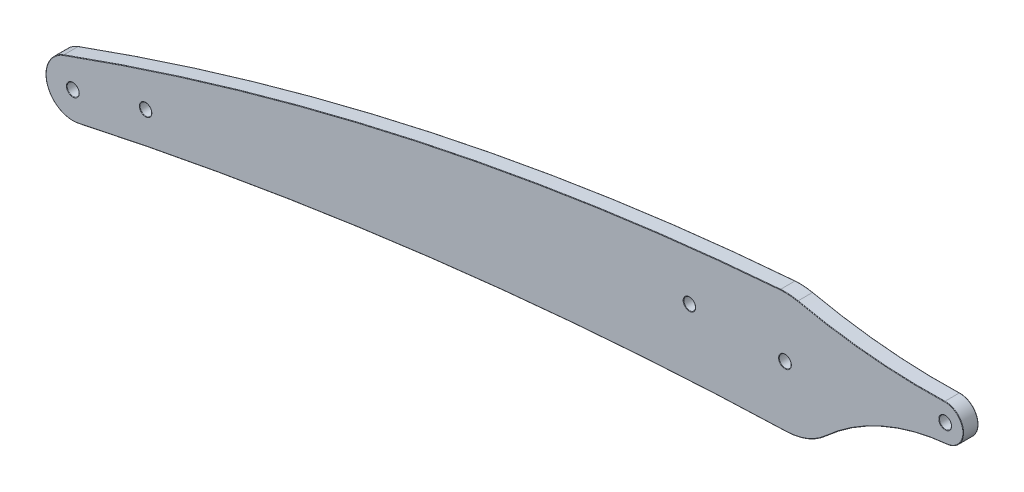
ISO-10303-21;
HEADER;
FILE_DESCRIPTION(('STEP AP214'),'2;1');
FILE_NAME('part.step','',(''),(''),'','','');
FILE_SCHEMA(('AUTOMOTIVE_DESIGN { 1 0 10303 214 1 1 1 1 }'));
ENDSEC;
DATA;
#1=APPLICATION_CONTEXT('core data for automotive mechanical design processes');
#2=APPLICATION_PROTOCOL_DEFINITION('international standard','automotive_design',2000,#1);
#3=PRODUCT_CONTEXT('',#1,'mechanical');
#4=PRODUCT('Part','Part','',(#3));
#5=PRODUCT_RELATED_PRODUCT_CATEGORY('part','',(#4));
#6=PRODUCT_DEFINITION_FORMATION('','',#4);
#7=PRODUCT_DEFINITION_CONTEXT('part definition',#1,'design');
#8=PRODUCT_DEFINITION('design','',#6,#7);
#9=PRODUCT_DEFINITION_SHAPE('','',#8);
#10=(LENGTH_UNIT() NAMED_UNIT(*) SI_UNIT(.MILLI.,.METRE.));
#11=(NAMED_UNIT(*) PLANE_ANGLE_UNIT() SI_UNIT($,.RADIAN.));
#12=(NAMED_UNIT(*) SI_UNIT($,.STERADIAN.) SOLID_ANGLE_UNIT());
#13=UNCERTAINTY_MEASURE_WITH_UNIT(LENGTH_MEASURE(1.E-05),#10,'distance_accuracy_value','');
#14=(GEOMETRIC_REPRESENTATION_CONTEXT(3) GLOBAL_UNCERTAINTY_ASSIGNED_CONTEXT((#13)) GLOBAL_UNIT_ASSIGNED_CONTEXT((#10,
#11,#12)) REPRESENTATION_CONTEXT('',''));
#15=CARTESIAN_POINT('',(0.,0.,0.));
#16=DIRECTION('',(0.,0.,1.));
#17=DIRECTION('',(1.,0.,0.));
#18=AXIS2_PLACEMENT_3D('',#15,#16,#17);
#19=CARTESIAN_POINT('',(-273.701360714426,238.82392189989,-5.));
#20=DIRECTION('',(0.,0.,1.));
#21=DIRECTION('',(1.,0.,0.));
#22=AXIS2_PLACEMENT_3D('',#19,#20,#21);
#23=CYLINDRICAL_SURFACE('',#22,8.99999999999995);
#24=DIRECTION('',(0.,0.,1.));
#25=VECTOR('',#24,1.);
#26=CARTESIAN_POINT('',(-276.780298858593,247.280879976196,-5.));
#27=LINE('',#26,#25);
#28=CARTESIAN_POINT('',(-276.780298858593,247.280879976196,-4.85));
#29=VERTEX_POINT('',#28);
#30=CARTESIAN_POINT('',(-276.780298858593,247.280879976196,-0.15));
#31=VERTEX_POINT('',#30);
#32=EDGE_CURVE('E159',#29,#31,#27,.T.);
#33=ORIENTED_EDGE('',*,*,#32,.F.);
#34=CARTESIAN_POINT('',(-273.701360714426,238.82392189989,-4.85));
#35=DIRECTION('',(0.,0.,1.));
#36=DIRECTION('',(1.,0.,0.));
#37=AXIS2_PLACEMENT_3D('',#34,#35,#36);
#38=CIRCLE('',#37,8.99999999999995);
#39=CARTESIAN_POINT('',(-271.793567604584,230.028450027953,-4.85));
#40=VERTEX_POINT('',#39);
#41=EDGE_CURVE('E154',#29,#40,#38,.T.);
#42=ORIENTED_EDGE('',*,*,#41,.T.);
#43=DIRECTION('',(0.,0.,1.));
#44=VECTOR('',#43,1.);
#45=CARTESIAN_POINT('',(-271.793567604584,230.028450027953,-5.));
#46=LINE('',#45,#44);
#47=CARTESIAN_POINT('',(-271.793567604584,230.028450027953,-0.15));
#48=VERTEX_POINT('',#47);
#49=EDGE_CURVE('E156',#40,#48,#46,.T.);
#50=ORIENTED_EDGE('',*,*,#49,.T.);
#51=CARTESIAN_POINT('',(-273.701360714426,238.82392189989,-0.15));
#52=DIRECTION('',(0.,0.,1.));
#53=DIRECTION('',(1.,0.,0.));
#54=AXIS2_PLACEMENT_3D('',#51,#52,#53);
#55=CIRCLE('',#54,8.99999999999995);
#56=EDGE_CURVE('E166',#48,#31,#55,.F.);
#57=ORIENTED_EDGE('',*,*,#56,.T.);
#58=EDGE_LOOP('',(#33,#42,#50,#57));
#59=FACE_BOUND('',#58,.T.);
#60=ADVANCED_FACE('F39',(#59),#23,.T.);
#61=CARTESIAN_POINT('',(31.1135155580963,-598.414927654386,-5.));
#62=DIRECTION('',(0.,0.,1.));
#63=DIRECTION('',(1.,0.,0.));
#64=AXIS2_PLACEMENT_3D('',#61,#62,#63);
#65=CYLINDRICAL_SURFACE('',#64,900.);
#66=DIRECTION('',(0.,0.,1.));
#67=VECTOR('',#66,1.);
#68=CARTESIAN_POINT('',(-38.6274540706312,298.878891089087,-5.));
#69=LINE('',#68,#67);
#70=CARTESIAN_POINT('',(-38.6274540706312,298.878891089087,-4.85));
#71=VERTEX_POINT('',#70);
#72=CARTESIAN_POINT('',(-38.6274540706312,298.878891089087,-0.15));
#73=VERTEX_POINT('',#72);
#74=EDGE_CURVE('E449',#71,#73,#69,.T.);
#75=ORIENTED_EDGE('',*,*,#74,.F.);
#76=CARTESIAN_POINT('',(31.1135155580963,-598.414927654386,-4.85));
#77=DIRECTION('',(0.,0.,1.));
#78=DIRECTION('',(1.,0.,0.));
#79=AXIS2_PLACEMENT_3D('',#76,#77,#78);
#80=CIRCLE('',#79,900.);
#81=EDGE_CURVE('E277',#71,#29,#80,.T.);
#82=ORIENTED_EDGE('',*,*,#81,.T.);
#83=ORIENTED_EDGE('',*,*,#32,.T.);
#84=CARTESIAN_POINT('',(31.1135155580963,-598.414927654386,-0.15));
#85=DIRECTION('',(0.,0.,1.));
#86=DIRECTION('',(1.,0.,0.));
#87=AXIS2_PLACEMENT_3D('',#84,#85,#86);
#88=CIRCLE('',#87,900.);
#89=EDGE_CURVE('E273',#31,#73,#88,.F.);
#90=ORIENTED_EDGE('',*,*,#89,.T.);
#91=EDGE_LOOP('',(#75,#82,#83,#90));
#92=FACE_BOUND('',#91,.T.);
#93=ADVANCED_FACE('F457',(#92),#65,.T.);
#94=CARTESIAN_POINT('',(-37.0776547455483,278.939028450343,-5.));
#95=DIRECTION('',(0.,0.,1.));
#96=DIRECTION('',(1.,0.,0.));
#97=AXIS2_PLACEMENT_3D('',#94,#95,#96);
#98=CYLINDRICAL_SURFACE('',#97,20.0000000000001);
#99=DIRECTION('',(0.,0.,1.));
#100=VECTOR('',#99,1.);
#101=CARTESIAN_POINT('',(-32.8087402126741,298.478126912427,-5.));
#102=LINE('',#101,#100);
#103=CARTESIAN_POINT('',(-32.8087402126741,298.478126912427,-4.85));
#104=VERTEX_POINT('',#103);
#105=CARTESIAN_POINT('',(-32.8087402126741,298.478126912427,-0.15));
#106=VERTEX_POINT('',#105);
#107=EDGE_CURVE('E445',#104,#106,#102,.T.);
#108=ORIENTED_EDGE('',*,*,#107,.F.);
#109=CARTESIAN_POINT('',(-37.0776547455483,278.939028450343,-4.85));
#110=DIRECTION('',(0.,0.,1.));
#111=DIRECTION('',(1.,0.,0.));
#112=AXIS2_PLACEMENT_3D('',#109,#110,#111);
#113=CIRCLE('',#112,20.0000000000001);
#114=EDGE_CURVE('E270',#104,#71,#113,.T.);
#115=ORIENTED_EDGE('',*,*,#114,.T.);
#116=ORIENTED_EDGE('',*,*,#74,.T.);
#117=CARTESIAN_POINT('',(-37.0776547455483,278.939028450343,-0.15));
#118=DIRECTION('',(0.,0.,1.));
#119=DIRECTION('',(1.,0.,0.));
#120=AXIS2_PLACEMENT_3D('',#117,#118,#119);
#121=CIRCLE('',#120,20.0000000000001);
#122=EDGE_CURVE('E267',#73,#106,#121,.F.);
#123=ORIENTED_EDGE('',*,*,#122,.T.);
#124=EDGE_LOOP('',(#108,#115,#116,#123));
#125=FACE_BOUND('',#124,.T.);
#126=ADVANCED_FACE('F511',(#125),#98,.T.);
#127=CARTESIAN_POINT('',(9.88040511606791,493.869111533268,-5.));
#128=DIRECTION('',(0.,0.,1.));
#129=DIRECTION('',(1.,0.,0.));
#130=AXIS2_PLACEMENT_3D('',#127,#128,#129);
#131=CYLINDRICAL_SURFACE('',#130,200.);
#132=DIRECTION('',(0.,0.,1.));
#133=VECTOR('',#132,1.);
#134=CARTESIAN_POINT('',(15.9797002436225,293.962136670091,-5.));
#135=LINE('',#134,#133);
#136=CARTESIAN_POINT('',(15.9797002436225,293.962136670091,-4.85));
#137=VERTEX_POINT('',#136);
#138=CARTESIAN_POINT('',(15.9797002436225,293.962136670091,-0.15));
#139=VERTEX_POINT('',#138);
#140=EDGE_CURVE('E438',#137,#139,#135,.T.);
#141=ORIENTED_EDGE('',*,*,#140,.F.);
#142=CARTESIAN_POINT('',(9.88040511606791,493.869111533268,-4.85));
#143=DIRECTION('',(0.,0.,1.));
#144=DIRECTION('',(1.,0.,0.));
#145=AXIS2_PLACEMENT_3D('',#142,#143,#144);
#146=CIRCLE('',#145,200.);
#147=EDGE_CURVE('E264',#137,#104,#146,.F.);
#148=ORIENTED_EDGE('',*,*,#147,.T.);
#149=ORIENTED_EDGE('',*,*,#107,.T.);
#150=CARTESIAN_POINT('',(9.88040511606791,493.869111533268,-0.15));
#151=DIRECTION('',(0.,0.,1.));
#152=DIRECTION('',(1.,0.,0.));
#153=AXIS2_PLACEMENT_3D('',#150,#151,#152);
#154=CIRCLE('',#153,200.);
#155=EDGE_CURVE('E261',#106,#139,#154,.T.);
#156=ORIENTED_EDGE('',*,*,#155,.T.);
#157=EDGE_LOOP('',(#141,#148,#149,#156));
#158=FACE_BOUND('',#157,.T.);
#159=ADVANCED_FACE('F804',(#158),#131,.F.);
#160=CARTESIAN_POINT('',(16.1626790974491,287.964927424195,-5.));
#161=DIRECTION('',(0.,0.,1.));
#162=DIRECTION('',(1.,0.,0.));
#163=AXIS2_PLACEMENT_3D('',#160,#161,#162);
#164=CYLINDRICAL_SURFACE('',#163,6.);
#165=DIRECTION('',(0.,0.,1.));
#166=VECTOR('',#165,1.);
#167=CARTESIAN_POINT('',(16.7362842066318,281.992408928726,-5.));
#168=LINE('',#167,#166);
#169=CARTESIAN_POINT('',(16.7362842066318,281.992408928726,-4.85));
#170=VERTEX_POINT('',#169);
#171=CARTESIAN_POINT('',(16.7362842066318,281.992408928726,-0.15));
#172=VERTEX_POINT('',#171);
#173=EDGE_CURVE('E431',#170,#172,#168,.T.);
#174=ORIENTED_EDGE('',*,*,#173,.F.);
#175=CARTESIAN_POINT('',(16.1626790974491,287.964927424195,-4.85));
#176=DIRECTION('',(0.,0.,1.));
#177=DIRECTION('',(1.,0.,0.));
#178=AXIS2_PLACEMENT_3D('',#175,#176,#177);
#179=CIRCLE('',#178,6.);
#180=EDGE_CURVE('E258',#170,#137,#179,.T.);
#181=ORIENTED_EDGE('',*,*,#180,.T.);
#182=ORIENTED_EDGE('',*,*,#140,.T.);
#183=CARTESIAN_POINT('',(16.1626790974491,287.964927424195,-0.15));
#184=DIRECTION('',(0.,0.,1.));
#185=DIRECTION('',(1.,0.,0.));
#186=AXIS2_PLACEMENT_3D('',#183,#184,#185);
#187=CIRCLE('',#186,6.);
#188=EDGE_CURVE('E255',#139,#172,#187,.F.);
#189=ORIENTED_EDGE('',*,*,#188,.T.);
#190=EDGE_LOOP('',(#174,#181,#182,#189));
#191=FACE_BOUND('',#190,.T.);
#192=ADVANCED_FACE('F796',(#191),#164,.T.);
#193=CARTESIAN_POINT('',(23.4283438137629,212.313026481588,-5.));
#194=DIRECTION('',(0.,0.,1.));
#195=DIRECTION('',(1.,0.,0.));
#196=AXIS2_PLACEMENT_3D('',#193,#194,#195);
#197=CYLINDRICAL_SURFACE('',#196,70.);
#198=DIRECTION('',(0.,0.,1.));
#199=VECTOR('',#198,1.);
#200=CARTESIAN_POINT('',(-23.6318772879236,264.133250235064,-5.));
#201=LINE('',#200,#199);
#202=CARTESIAN_POINT('',(-23.6318772879236,264.133250235064,-4.85));
#203=VERTEX_POINT('',#202);
#204=CARTESIAN_POINT('',(-23.6318772879236,264.133250235064,-0.15));
#205=VERTEX_POINT('',#204);
#206=EDGE_CURVE('E428',#203,#205,#201,.T.);
#207=ORIENTED_EDGE('',*,*,#206,.F.);
#208=CARTESIAN_POINT('',(23.4283438137629,212.313026481588,-4.85));
#209=DIRECTION('',(0.,0.,1.));
#210=DIRECTION('',(1.,0.,0.));
#211=AXIS2_PLACEMENT_3D('',#208,#209,#210);
#212=CIRCLE('',#211,70.);
#213=EDGE_CURVE('E252',#203,#170,#212,.F.);
#214=ORIENTED_EDGE('',*,*,#213,.T.);
#215=ORIENTED_EDGE('',*,*,#173,.T.);
#216=CARTESIAN_POINT('',(23.4283438137629,212.313026481588,-0.15));
#217=DIRECTION('',(0.,0.,1.));
#218=DIRECTION('',(1.,0.,0.));
#219=AXIS2_PLACEMENT_3D('',#216,#217,#218);
#220=CIRCLE('',#219,70.);
#221=EDGE_CURVE('E249',#172,#205,#220,.T.);
#222=ORIENTED_EDGE('',*,*,#221,.T.);
#223=EDGE_LOOP('',(#207,#214,#215,#222));
#224=FACE_BOUND('',#223,.T.);
#225=ADVANCED_FACE('F427',(#224),#197,.F.);
#226=CARTESIAN_POINT('',(-37.0776547455483,278.939028450343,-5.));
#227=DIRECTION('',(0.,0.,1.));
#228=DIRECTION('',(1.,0.,0.));
#229=AXIS2_PLACEMENT_3D('',#226,#227,#228);
#230=CYLINDRICAL_SURFACE('',#229,20.);
#231=DIRECTION('',(0.,0.,1.));
#232=VECTOR('',#231,1.);
#233=CARTESIAN_POINT('',(-36.4586516696847,258.94860986563,-5.));
#234=LINE('',#233,#232);
#235=CARTESIAN_POINT('',(-36.4586516696847,258.94860986563,-4.85));
#236=VERTEX_POINT('',#235);
#237=CARTESIAN_POINT('',(-36.4586516696847,258.94860986563,-0.15));
#238=VERTEX_POINT('',#237);
#239=EDGE_CURVE('E178',#236,#238,#234,.T.);
#240=ORIENTED_EDGE('',*,*,#239,.F.);
#241=CARTESIAN_POINT('',(-37.0776547455483,278.939028450343,-4.85));
#242=DIRECTION('',(0.,0.,1.));
#243=DIRECTION('',(1.,0.,0.));
#244=AXIS2_PLACEMENT_3D('',#241,#242,#243);
#245=CIRCLE('',#244,20.);
#246=EDGE_CURVE('E246',#236,#203,#245,.T.);
#247=ORIENTED_EDGE('',*,*,#246,.T.);
#248=ORIENTED_EDGE('',*,*,#206,.T.);
#249=CARTESIAN_POINT('',(-37.0776547455483,278.939028450343,-0.15));
#250=DIRECTION('',(0.,0.,1.));
#251=DIRECTION('',(1.,0.,0.));
#252=AXIS2_PLACEMENT_3D('',#249,#250,#251);
#253=CIRCLE('',#252,20.);
#254=EDGE_CURVE('E243',#205,#238,#253,.F.);
#255=ORIENTED_EDGE('',*,*,#254,.T.);
#256=EDGE_LOOP('',(#240,#247,#248,#255));
#257=FACE_BOUND('',#256,.T.);
#258=ADVANCED_FACE('F433',(#257),#230,.T.);
#259=CARTESIAN_POINT('',(3.77654826145224,-1040.42859814077,-5.));
#260=DIRECTION('',(0.,0.,1.));
#261=DIRECTION('',(1.,0.,0.));
#262=AXIS2_PLACEMENT_3D('',#259,#260,#261);
#263=CYLINDRICAL_SURFACE('',#262,1300.);
#264=ORIENTED_EDGE('',*,*,#49,.F.);
#265=CARTESIAN_POINT('',(3.77654826145224,-1040.42859814077,-4.85));
#266=DIRECTION('',(0.,0.,1.));
#267=DIRECTION('',(1.,0.,0.));
#268=AXIS2_PLACEMENT_3D('',#265,#266,#267);
#269=CIRCLE('',#268,1300.);
#270=EDGE_CURVE('E173',#40,#236,#269,.F.);
#271=ORIENTED_EDGE('',*,*,#270,.T.);
#272=ORIENTED_EDGE('',*,*,#239,.T.);
#273=CARTESIAN_POINT('',(3.77654826145224,-1040.42859814077,-0.15));
#274=DIRECTION('',(0.,0.,1.));
#275=DIRECTION('',(1.,0.,0.));
#276=AXIS2_PLACEMENT_3D('',#273,#274,#275);
#277=CIRCLE('',#276,1300.);
#278=EDGE_CURVE('E176',#238,#48,#277,.T.);
#279=ORIENTED_EDGE('',*,*,#278,.T.);
#280=EDGE_LOOP('',(#264,#271,#272,#279));
#281=FACE_BOUND('',#280,.T.);
#282=ADVANCED_FACE('F170',(#281),#263,.F.);
#283=CARTESIAN_POINT('',(-134.962406226487,-400.802338120439,-5.));
#284=DIRECTION('',(0.,0.,1.));
#285=DIRECTION('',(1.,0.,0.));
#286=AXIS2_PLACEMENT_3D('',#283,#284,#285);
#287=PLANE('',#286);
#288=CARTESIAN_POINT('',(-37.0776547455483,278.939028450343,-5.));
#289=DIRECTION('',(0.,0.,1.));
#290=DIRECTION('',(1.,0.,0.));
#291=AXIS2_PLACEMENT_3D('',#288,#289,#290);
#292=CIRCLE('',#291,19.85);
#293=CARTESIAN_POINT('',(-23.7327206188558,264.244293571679,-5.));
#294=VERTEX_POINT('',#293);
#295=CARTESIAN_POINT('',(-36.4632941927537,259.098538005015,-5.));
#296=VERTEX_POINT('',#295);
#297=EDGE_CURVE('E237',#294,#296,#292,.F.);
#298=ORIENTED_EDGE('',*,*,#297,.T.);
#299=CARTESIAN_POINT('',(3.77654826145224,-1040.42859814077,-5.));
#300=DIRECTION('',(0.,0.,1.));
#301=DIRECTION('',(1.,0.,0.));
#302=AXIS2_PLACEMENT_3D('',#299,#300,#301);
#303=CIRCLE('',#302,1300.15);
#304=CARTESIAN_POINT('',(-271.825364156415,230.175041225818,-5.));
#305=VERTEX_POINT('',#304);
#306=EDGE_CURVE('E240',#296,#305,#303,.T.);
#307=ORIENTED_EDGE('',*,*,#306,.T.);
#308=CARTESIAN_POINT('',(-273.701360714426,238.82392189989,-5.));
#309=DIRECTION('',(0.,0.,1.));
#310=DIRECTION('',(1.,0.,0.));
#311=AXIS2_PLACEMENT_3D('',#308,#309,#310);
#312=CIRCLE('',#311,8.84999999999995);
#313=CARTESIAN_POINT('',(-276.728983222856,247.139930674924,-5.));
#314=VERTEX_POINT('',#313);
#315=EDGE_CURVE('E184',#305,#314,#312,.F.);
#316=ORIENTED_EDGE('',*,*,#315,.T.);
#317=CARTESIAN_POINT('',(31.1135155580963,-598.414927654386,-5.));
#318=DIRECTION('',(0.,0.,1.));
#319=DIRECTION('',(1.,0.,0.));
#320=AXIS2_PLACEMENT_3D('',#317,#318,#319);
#321=CIRCLE('',#320,899.85);
#322=CARTESIAN_POINT('',(-38.6158305756931,298.729342119297,-5.));
#323=VERTEX_POINT('',#322);
#324=EDGE_CURVE('E222',#314,#323,#321,.F.);
#325=ORIENTED_EDGE('',*,*,#324,.T.);
#326=CARTESIAN_POINT('',(-37.0776547455483,278.939028450343,-5.));
#327=DIRECTION('',(0.,0.,1.));
#328=DIRECTION('',(1.,0.,0.));
#329=AXIS2_PLACEMENT_3D('',#326,#327,#328);
#330=CIRCLE('',#329,19.8500000000001);
#331=CARTESIAN_POINT('',(-32.8407570716706,298.331583673962,-5.));
#332=VERTEX_POINT('',#331);
#333=EDGE_CURVE('E225',#323,#332,#330,.F.);
#334=ORIENTED_EDGE('',*,*,#333,.T.);
#335=CARTESIAN_POINT('',(9.88040511606791,493.869111533268,-5.));
#336=DIRECTION('',(0.,0.,1.));
#337=DIRECTION('',(1.,0.,0.));
#338=AXIS2_PLACEMENT_3D('',#335,#336,#337);
#339=CIRCLE('',#338,200.15);
#340=CARTESIAN_POINT('',(15.9842747149681,293.812206438943,-5.));
#341=VERTEX_POINT('',#340);
#342=EDGE_CURVE('E228',#332,#341,#339,.T.);
#343=ORIENTED_EDGE('',*,*,#342,.T.);
#344=CARTESIAN_POINT('',(16.1626790974491,287.964927424195,-5.));
#345=DIRECTION('',(0.,0.,1.));
#346=DIRECTION('',(1.,0.,0.));
#347=AXIS2_PLACEMENT_3D('',#344,#345,#346);
#348=CIRCLE('',#347,5.85);
#349=CARTESIAN_POINT('',(16.7219440789022,282.141721891113,-5.));
#350=VERTEX_POINT('',#349);
#351=EDGE_CURVE('E231',#341,#350,#348,.F.);
#352=ORIENTED_EDGE('',*,*,#351,.T.);
#353=CARTESIAN_POINT('',(23.4283438137629,212.313026481588,-5.));
#354=DIRECTION('',(0.,0.,1.));
#355=DIRECTION('',(1.,0.,0.));
#356=AXIS2_PLACEMENT_3D('',#353,#354,#355);
#357=CIRCLE('',#356,70.15);
#358=EDGE_CURVE('E234',#350,#294,#357,.T.);
#359=ORIENTED_EDGE('',*,*,#358,.T.);
#360=EDGE_LOOP('',(#298,#307,#316,#325,#334,#343,#352,#359));
#361=FACE_BOUND('',#360,.T.);
#362=CARTESIAN_POINT('',(-273.701360714426,238.82392189989,-5.));
#363=DIRECTION('',(0.,0.,1.));
#364=DIRECTION('',(1.,0.,0.));
#365=AXIS2_PLACEMENT_3D('',#362,#363,#364);
#366=CIRCLE('',#365,2.15);
#367=CARTESIAN_POINT('',(-271.551360714426,238.82392189989,-5.));
#368=VERTEX_POINT('',#367);
#369=EDGE_CURVE('E216',#368,#368,#366,.T.);
#370=ORIENTED_EDGE('',*,*,#369,.T.);
#371=EDGE_LOOP('',(#370));
#372=FACE_BOUND('',#371,.T.);
#373=CARTESIAN_POINT('',(-249.527266647018,245.196768675086,-5.));
#374=DIRECTION('',(0.,0.,1.));
#375=DIRECTION('',(1.,0.,0.));
#376=AXIS2_PLACEMENT_3D('',#373,#374,#375);
#377=CIRCLE('',#376,2.1);
#378=CARTESIAN_POINT('',(-247.427266647018,245.196768675086,-5.));
#379=VERTEX_POINT('',#378);
#380=EDGE_CURVE('E212',#379,#379,#377,.T.);
#381=ORIENTED_EDGE('',*,*,#380,.T.);
#382=EDGE_LOOP('',(#381));
#383=FACE_BOUND('',#382,.T.);
#384=CARTESIAN_POINT('',(-68.8276547455483,279.587808188343,-5.));
#385=DIRECTION('',(0.,0.,1.));
#386=DIRECTION('',(1.,0.,0.));
#387=AXIS2_PLACEMENT_3D('',#384,#385,#386);
#388=CIRCLE('',#387,2.09999999999999);
#389=CARTESIAN_POINT('',(-66.7276547455483,279.587808188343,-5.));
#390=VERTEX_POINT('',#389);
#391=EDGE_CURVE('E208',#390,#390,#388,.T.);
#392=ORIENTED_EDGE('',*,*,#391,.T.);
#393=EDGE_LOOP('',(#392));
#394=FACE_BOUND('',#393,.T.);
#395=CARTESIAN_POINT('',(-37.0776547455483,278.939028450343,-5.));
#396=DIRECTION('',(0.,0.,1.));
#397=DIRECTION('',(1.,0.,0.));
#398=AXIS2_PLACEMENT_3D('',#395,#396,#397);
#399=CIRCLE('',#398,2.15);
#400=CARTESIAN_POINT('',(-34.9276547455483,278.939028450343,-5.));
#401=VERTEX_POINT('',#400);
#402=EDGE_CURVE('E201',#401,#401,#399,.T.);
#403=ORIENTED_EDGE('',*,*,#402,.T.);
#404=EDGE_LOOP('',(#403));
#405=FACE_BOUND('',#404,.T.);
#406=CARTESIAN_POINT('',(16.1626790974491,287.964927424195,-5.));
#407=DIRECTION('',(0.,0.,1.));
#408=DIRECTION('',(1.,0.,0.));
#409=AXIS2_PLACEMENT_3D('',#406,#407,#408);
#410=CIRCLE('',#409,2.15);
#411=CARTESIAN_POINT('',(18.3126790974491,287.964927424195,-5.));
#412=VERTEX_POINT('',#411);
#413=EDGE_CURVE('E196',#412,#412,#410,.T.);
#414=ORIENTED_EDGE('',*,*,#413,.T.);
#415=EDGE_LOOP('',(#414));
#416=FACE_BOUND('',#415,.T.);
#417=ADVANCED_FACE('F473',(#361,#372,#383,#394,#405,#416),#287,.F.);
#418=CARTESIAN_POINT('',(-134.962406226487,-400.802338120439,0.));
#419=DIRECTION('',(0.,0.,1.));
#420=DIRECTION('',(1.,0.,0.));
#421=AXIS2_PLACEMENT_3D('',#418,#419,#420);
#422=PLANE('',#421);
#423=CARTESIAN_POINT('',(-37.0776547455483,278.939028450343,0.));
#424=DIRECTION('',(0.,0.,1.));
#425=DIRECTION('',(1.,0.,0.));
#426=AXIS2_PLACEMENT_3D('',#423,#424,#425);
#427=CIRCLE('',#426,19.8500000000001);
#428=CARTESIAN_POINT('',(-32.8407570716707,298.331583673962,0.));
#429=VERTEX_POINT('',#428);
#430=CARTESIAN_POINT('',(-38.6158305756931,298.729342119297,0.));
#431=VERTEX_POINT('',#430);
#432=EDGE_CURVE('E49',#429,#431,#427,.T.);
#433=ORIENTED_EDGE('',*,*,#432,.T.);
#434=CARTESIAN_POINT('',(31.1135155580963,-598.414927654386,0.));
#435=DIRECTION('',(0.,0.,1.));
#436=DIRECTION('',(1.,0.,0.));
#437=AXIS2_PLACEMENT_3D('',#434,#435,#436);
#438=CIRCLE('',#437,899.85);
#439=CARTESIAN_POINT('',(-276.728983222856,247.139930674924,0.));
#440=VERTEX_POINT('',#439);
#441=EDGE_CURVE('E11',#431,#440,#438,.T.);
#442=ORIENTED_EDGE('',*,*,#441,.T.);
#443=CARTESIAN_POINT('',(-273.701360714426,238.82392189989,0.));
#444=DIRECTION('',(0.,0.,1.));
#445=DIRECTION('',(1.,0.,0.));
#446=AXIS2_PLACEMENT_3D('',#443,#444,#445);
#447=CIRCLE('',#446,8.84999999999995);
#448=CARTESIAN_POINT('',(-271.825364156415,230.175041225818,0.));
#449=VERTEX_POINT('',#448);
#450=EDGE_CURVE('E341',#440,#449,#447,.T.);
#451=ORIENTED_EDGE('',*,*,#450,.T.);
#452=CARTESIAN_POINT('',(3.77654826145224,-1040.42859814077,0.));
#453=DIRECTION('',(0.,0.,1.));
#454=DIRECTION('',(1.,0.,0.));
#455=AXIS2_PLACEMENT_3D('',#452,#453,#454);
#456=CIRCLE('',#455,1300.15);
#457=CARTESIAN_POINT('',(-36.4632941927537,259.098538005015,0.));
#458=VERTEX_POINT('',#457);
#459=EDGE_CURVE('E344',#449,#458,#456,.F.);
#460=ORIENTED_EDGE('',*,*,#459,.T.);
#461=CARTESIAN_POINT('',(-37.0776547455483,278.939028450343,0.));
#462=DIRECTION('',(0.,0.,1.));
#463=DIRECTION('',(1.,0.,0.));
#464=AXIS2_PLACEMENT_3D('',#461,#462,#463);
#465=CIRCLE('',#464,19.85);
#466=CARTESIAN_POINT('',(-23.7327206188558,264.244293571679,0.));
#467=VERTEX_POINT('',#466);
#468=EDGE_CURVE('E347',#458,#467,#465,.T.);
#469=ORIENTED_EDGE('',*,*,#468,.T.);
#470=CARTESIAN_POINT('',(23.4283438137629,212.313026481588,0.));
#471=DIRECTION('',(0.,0.,1.));
#472=DIRECTION('',(1.,0.,0.));
#473=AXIS2_PLACEMENT_3D('',#470,#471,#472);
#474=CIRCLE('',#473,70.15);
#475=CARTESIAN_POINT('',(16.7219440789022,282.141721891113,0.));
#476=VERTEX_POINT('',#475);
#477=EDGE_CURVE('E350',#467,#476,#474,.F.);
#478=ORIENTED_EDGE('',*,*,#477,.T.);
#479=CARTESIAN_POINT('',(16.1626790974491,287.964927424195,0.));
#480=DIRECTION('',(0.,0.,1.));
#481=DIRECTION('',(1.,0.,0.));
#482=AXIS2_PLACEMENT_3D('',#479,#480,#481);
#483=CIRCLE('',#482,5.85);
#484=CARTESIAN_POINT('',(15.9842747149682,293.812206438943,0.));
#485=VERTEX_POINT('',#484);
#486=EDGE_CURVE('E353',#476,#485,#483,.T.);
#487=ORIENTED_EDGE('',*,*,#486,.T.);
#488=CARTESIAN_POINT('',(9.88040511606791,493.869111533268,0.));
#489=DIRECTION('',(0.,0.,1.));
#490=DIRECTION('',(1.,0.,0.));
#491=AXIS2_PLACEMENT_3D('',#488,#489,#490);
#492=CIRCLE('',#491,200.15);
#493=EDGE_CURVE('E60',#485,#429,#492,.F.);
#494=ORIENTED_EDGE('',*,*,#493,.T.);
#495=EDGE_LOOP('',(#433,#442,#451,#460,#469,#478,#487,#494));
#496=FACE_BOUND('',#495,.T.);
#497=CARTESIAN_POINT('',(-273.701360714426,238.82392189989,0.));
#498=DIRECTION('',(0.,0.,1.));
#499=DIRECTION('',(1.,0.,0.));
#500=AXIS2_PLACEMENT_3D('',#497,#498,#499);
#501=CIRCLE('',#500,2.15);
#502=CARTESIAN_POINT('',(-271.551360714426,238.82392189989,0.));
#503=VERTEX_POINT('',#502);
#504=EDGE_CURVE('E337',#503,#503,#501,.F.);
#505=ORIENTED_EDGE('',*,*,#504,.T.);
#506=EDGE_LOOP('',(#505));
#507=FACE_BOUND('',#506,.T.);
#508=CARTESIAN_POINT('',(-249.527266647018,245.196768675086,0.));
#509=DIRECTION('',(0.,0.,1.));
#510=DIRECTION('',(1.,0.,0.));
#511=AXIS2_PLACEMENT_3D('',#508,#509,#510);
#512=CIRCLE('',#511,2.1);
#513=CARTESIAN_POINT('',(-247.427266647018,245.196768675086,0.));
#514=VERTEX_POINT('',#513);
#515=EDGE_CURVE('E333',#514,#514,#512,.F.);
#516=ORIENTED_EDGE('',*,*,#515,.T.);
#517=EDGE_LOOP('',(#516));
#518=FACE_BOUND('',#517,.T.);
#519=CARTESIAN_POINT('',(-68.8276547455483,279.587808188343,0.));
#520=DIRECTION('',(0.,0.,1.));
#521=DIRECTION('',(1.,0.,0.));
#522=AXIS2_PLACEMENT_3D('',#519,#520,#521);
#523=CIRCLE('',#522,2.09999999999999);
#524=CARTESIAN_POINT('',(-66.7276547455483,279.587808188343,0.));
#525=VERTEX_POINT('',#524);
#526=EDGE_CURVE('E329',#525,#525,#523,.F.);
#527=ORIENTED_EDGE('',*,*,#526,.T.);
#528=EDGE_LOOP('',(#527));
#529=FACE_BOUND('',#528,.T.);
#530=CARTESIAN_POINT('',(-37.0776547455483,278.939028450343,0.));
#531=DIRECTION('',(0.,0.,1.));
#532=DIRECTION('',(1.,0.,0.));
#533=AXIS2_PLACEMENT_3D('',#530,#531,#532);
#534=CIRCLE('',#533,2.15);
#535=CARTESIAN_POINT('',(-34.9276547455483,278.939028450343,0.));
#536=VERTEX_POINT('',#535);
#537=EDGE_CURVE('E325',#536,#536,#534,.F.);
#538=ORIENTED_EDGE('',*,*,#537,.T.);
#539=EDGE_LOOP('',(#538));
#540=FACE_BOUND('',#539,.T.);
#541=CARTESIAN_POINT('',(16.1626790974491,287.964927424195,0.));
#542=DIRECTION('',(0.,0.,1.));
#543=DIRECTION('',(1.,0.,0.));
#544=AXIS2_PLACEMENT_3D('',#541,#542,#543);
#545=CIRCLE('',#544,2.15);
#546=CARTESIAN_POINT('',(18.3126790974491,287.964927424195,0.));
#547=VERTEX_POINT('',#546);
#548=EDGE_CURVE('E321',#547,#547,#545,.F.);
#549=ORIENTED_EDGE('',*,*,#548,.T.);
#550=EDGE_LOOP('',(#549));
#551=FACE_BOUND('',#550,.T.);
#552=ADVANCED_FACE('F469',(#496,#507,#518,#529,#540,#551),#422,.T.);
#553=CARTESIAN_POINT('',(-273.701360714426,238.82392189989,-5.));
#554=DIRECTION('',(0.,0.,1.));
#555=DIRECTION('',(1.,0.,0.));
#556=AXIS2_PLACEMENT_3D('',#553,#554,#555);
#557=CYLINDRICAL_SURFACE('',#556,2.);
#558=CARTESIAN_POINT('',(-273.701360714426,238.82392189989,-4.85));
#559=DIRECTION('',(0.,0.,1.));
#560=DIRECTION('',(1.,0.,0.));
#561=AXIS2_PLACEMENT_3D('',#558,#559,#560);
#562=CIRCLE('',#561,2.);
#563=CARTESIAN_POINT('',(-271.701360714426,238.82392189989,-4.85));
#564=VERTEX_POINT('',#563);
#565=EDGE_CURVE('E285',#564,#564,#562,.F.);
#566=ORIENTED_EDGE('',*,*,#565,.T.);
#567=EDGE_LOOP('',(#566));
#568=FACE_BOUND('',#567,.T.);
#569=CARTESIAN_POINT('',(-273.701360714426,238.82392189989,-0.15));
#570=DIRECTION('',(0.,0.,1.));
#571=DIRECTION('',(1.,0.,0.));
#572=AXIS2_PLACEMENT_3D('',#569,#570,#571);
#573=CIRCLE('',#572,2.);
#574=CARTESIAN_POINT('',(-271.701360714426,238.82392189989,-0.15));
#575=VERTEX_POINT('',#574);
#576=EDGE_CURVE('E165',#575,#575,#573,.T.);
#577=ORIENTED_EDGE('',*,*,#576,.T.);
#578=EDGE_LOOP('',(#577));
#579=FACE_BOUND('',#578,.T.);
#580=ADVANCED_FACE('F472',(#568,#579),#557,.F.);
#581=CARTESIAN_POINT('',(-249.527266647018,245.196768675086,-5.));
#582=DIRECTION('',(0.,0.,1.));
#583=DIRECTION('',(1.,0.,0.));
#584=AXIS2_PLACEMENT_3D('',#581,#582,#583);
#585=CYLINDRICAL_SURFACE('',#584,1.95);
#586=CARTESIAN_POINT('',(-249.527266647018,245.196768675086,-4.85));
#587=DIRECTION('',(0.,0.,1.));
#588=DIRECTION('',(1.,0.,0.));
#589=AXIS2_PLACEMENT_3D('',#586,#587,#588);
#590=CIRCLE('',#589,1.95);
#591=CARTESIAN_POINT('',(-247.577266647018,245.196768675086,-4.85));
#592=VERTEX_POINT('',#591);
#593=EDGE_CURVE('E293',#592,#592,#590,.F.);
#594=ORIENTED_EDGE('',*,*,#593,.T.);
#595=EDGE_LOOP('',(#594));
#596=FACE_BOUND('',#595,.T.);
#597=CARTESIAN_POINT('',(-249.527266647018,245.196768675086,-0.15));
#598=DIRECTION('',(0.,0.,1.));
#599=DIRECTION('',(1.,0.,0.));
#600=AXIS2_PLACEMENT_3D('',#597,#598,#599);
#601=CIRCLE('',#600,1.95);
#602=CARTESIAN_POINT('',(-247.577266647018,245.196768675086,-0.15));
#603=VERTEX_POINT('',#602);
#604=EDGE_CURVE('E289',#603,#603,#601,.T.);
#605=ORIENTED_EDGE('',*,*,#604,.T.);
#606=EDGE_LOOP('',(#605));
#607=FACE_BOUND('',#606,.T.);
#608=ADVANCED_FACE('F746',(#596,#607),#585,.F.);
#609=CARTESIAN_POINT('',(-68.8276547455483,279.587808188343,-5.));
#610=DIRECTION('',(0.,0.,1.));
#611=DIRECTION('',(1.,0.,0.));
#612=AXIS2_PLACEMENT_3D('',#609,#610,#611);
#613=CYLINDRICAL_SURFACE('',#612,1.94999999999999);
#614=CARTESIAN_POINT('',(-68.8276547455483,279.587808188343,-4.85));
#615=DIRECTION('',(0.,0.,1.));
#616=DIRECTION('',(1.,0.,0.));
#617=AXIS2_PLACEMENT_3D('',#614,#615,#616);
#618=CIRCLE('',#617,1.94999999999999);
#619=CARTESIAN_POINT('',(-66.8776547455483,279.587808188343,-4.85));
#620=VERTEX_POINT('',#619);
#621=EDGE_CURVE('E301',#620,#620,#618,.F.);
#622=ORIENTED_EDGE('',*,*,#621,.T.);
#623=EDGE_LOOP('',(#622));
#624=FACE_BOUND('',#623,.T.);
#625=CARTESIAN_POINT('',(-68.8276547455483,279.587808188343,-0.15));
#626=DIRECTION('',(0.,0.,1.));
#627=DIRECTION('',(1.,0.,0.));
#628=AXIS2_PLACEMENT_3D('',#625,#626,#627);
#629=CIRCLE('',#628,1.94999999999999);
#630=CARTESIAN_POINT('',(-66.8776547455483,279.587808188343,-0.15));
#631=VERTEX_POINT('',#630);
#632=EDGE_CURVE('E297',#631,#631,#629,.T.);
#633=ORIENTED_EDGE('',*,*,#632,.T.);
#634=EDGE_LOOP('',(#633));
#635=FACE_BOUND('',#634,.T.);
#636=ADVANCED_FACE('F503',(#624,#635),#613,.F.);
#637=CARTESIAN_POINT('',(-37.0776547455483,278.939028450343,-5.));
#638=DIRECTION('',(0.,0.,1.));
#639=DIRECTION('',(1.,0.,0.));
#640=AXIS2_PLACEMENT_3D('',#637,#638,#639);
#641=CYLINDRICAL_SURFACE('',#640,2.);
#642=CARTESIAN_POINT('',(-37.0776547455483,278.939028450343,-4.85));
#643=DIRECTION('',(0.,0.,1.));
#644=DIRECTION('',(1.,0.,0.));
#645=AXIS2_PLACEMENT_3D('',#642,#643,#644);
#646=CIRCLE('',#645,2.);
#647=CARTESIAN_POINT('',(-35.0776547455483,278.939028450343,-4.85));
#648=VERTEX_POINT('',#647);
#649=EDGE_CURVE('E309',#648,#648,#646,.F.);
#650=ORIENTED_EDGE('',*,*,#649,.T.);
#651=EDGE_LOOP('',(#650));
#652=FACE_BOUND('',#651,.T.);
#653=CARTESIAN_POINT('',(-37.0776547455483,278.939028450343,-0.15));
#654=DIRECTION('',(0.,0.,1.));
#655=DIRECTION('',(1.,0.,0.));
#656=AXIS2_PLACEMENT_3D('',#653,#654,#655);
#657=CIRCLE('',#656,2.);
#658=CARTESIAN_POINT('',(-35.0776547455483,278.939028450343,-0.15));
#659=VERTEX_POINT('',#658);
#660=EDGE_CURVE('E305',#659,#659,#657,.T.);
#661=ORIENTED_EDGE('',*,*,#660,.T.);
#662=EDGE_LOOP('',(#661));
#663=FACE_BOUND('',#662,.T.);
#664=ADVANCED_FACE('F493',(#652,#663),#641,.F.);
#665=CARTESIAN_POINT('',(16.1626790974491,287.964927424195,-5.));
#666=DIRECTION('',(0.,0.,1.));
#667=DIRECTION('',(1.,0.,0.));
#668=AXIS2_PLACEMENT_3D('',#665,#666,#667);
#669=CYLINDRICAL_SURFACE('',#668,2.);
#670=CARTESIAN_POINT('',(16.1626790974491,287.964927424195,-4.85));
#671=DIRECTION('',(0.,0.,1.));
#672=DIRECTION('',(1.,0.,0.));
#673=AXIS2_PLACEMENT_3D('',#670,#671,#672);
#674=CIRCLE('',#673,2.);
#675=CARTESIAN_POINT('',(18.1626790974491,287.964927424195,-4.85));
#676=VERTEX_POINT('',#675);
#677=EDGE_CURVE('E317',#676,#676,#674,.F.);
#678=ORIENTED_EDGE('',*,*,#677,.T.);
#679=EDGE_LOOP('',(#678));
#680=FACE_BOUND('',#679,.T.);
#681=CARTESIAN_POINT('',(16.1626790974491,287.964927424195,-0.15));
#682=DIRECTION('',(0.,0.,1.));
#683=DIRECTION('',(1.,0.,0.));
#684=AXIS2_PLACEMENT_3D('',#681,#682,#683);
#685=CIRCLE('',#684,2.);
#686=CARTESIAN_POINT('',(18.1626790974491,287.964927424195,-0.15));
#687=VERTEX_POINT('',#686);
#688=EDGE_CURVE('E313',#687,#687,#685,.T.);
#689=ORIENTED_EDGE('',*,*,#688,.T.);
#690=EDGE_LOOP('',(#689));
#691=FACE_BOUND('',#690,.T.);
#692=ADVANCED_FACE('F490',(#680,#691),#669,.F.);
#693=CARTESIAN_POINT('',(9.88040511606791,493.869111533268,-4.85));
#694=DIRECTION('',(0.,0.,1.));
#695=DIRECTION('',(1.,0.,0.));
#696=AXIS2_PLACEMENT_3D('',#693,#694,#695);
#697=TOROIDAL_SURFACE('',#696,200.15,0.15);
#698=CARTESIAN_POINT('',(15.9842747149681,293.812206438943,-4.85));
#699=DIRECTION('',(0.999534874315886,0.0304964756377688,0.));
#700=DIRECTION('',(-0.0304964756377689,0.999534874315887,0.));
#701=AXIS2_PLACEMENT_3D('',#698,#699,#700);
#702=CIRCLE('',#701,0.15);
#703=EDGE_CURVE('E376',#341,#137,#702,.T.);
#704=ORIENTED_EDGE('',*,*,#703,.F.);
#705=ORIENTED_EDGE('',*,*,#342,.F.);
#706=CARTESIAN_POINT('',(-32.8407570716707,298.331583673962,-4.85));
#707=DIRECTION('',(-0.976954923104203,0.213445726643708,0.));
#708=DIRECTION('',(-0.213445726643708,-0.976954923104203,0.));
#709=AXIS2_PLACEMENT_3D('',#706,#707,#708);
#710=CIRCLE('',#709,0.15);
#711=EDGE_CURVE('E179',#104,#332,#710,.T.);
#712=ORIENTED_EDGE('',*,*,#711,.F.);
#713=ORIENTED_EDGE('',*,*,#147,.F.);
#714=EDGE_LOOP('',(#704,#705,#712,#713));
#715=FACE_BOUND('',#714,.T.);
#716=ADVANCED_FACE('F492',(#715),#697,.T.);
#717=CARTESIAN_POINT('',(-37.0776547455483,278.939028450343,-4.85));
#718=DIRECTION('',(0.,0.,1.));
#719=DIRECTION('',(1.,0.,0.));
#720=AXIS2_PLACEMENT_3D('',#717,#718,#719);
#721=TOROIDAL_SURFACE('',#720,19.8500000000001,0.15);
#722=ORIENTED_EDGE('',*,*,#711,.T.);
#723=ORIENTED_EDGE('',*,*,#333,.F.);
#724=CARTESIAN_POINT('',(-38.6158305756931,298.729342119297,-4.85));
#725=DIRECTION('',(-0.996993131937193,-0.0774899662541361,0.));
#726=DIRECTION('',(0.0774899662541361,-0.996993131937193,0.));
#727=AXIS2_PLACEMENT_3D('',#724,#725,#726);
#728=CIRCLE('',#727,0.15);
#729=EDGE_CURVE('E372',#71,#323,#728,.T.);
#730=ORIENTED_EDGE('',*,*,#729,.F.);
#731=ORIENTED_EDGE('',*,*,#114,.F.);
#732=EDGE_LOOP('',(#722,#723,#730,#731));
#733=FACE_BOUND('',#732,.T.);
#734=ADVANCED_FACE('F500',(#733),#721,.T.);
#735=CARTESIAN_POINT('',(16.1626790974491,287.964927424195,-4.85));
#736=DIRECTION('',(0.,0.,1.));
#737=DIRECTION('',(1.,0.,0.));
#738=AXIS2_PLACEMENT_3D('',#735,#736,#737);
#739=TOROIDAL_SURFACE('',#738,5.85,0.15);
#740=ORIENTED_EDGE('',*,*,#703,.T.);
#741=ORIENTED_EDGE('',*,*,#180,.F.);
#742=CARTESIAN_POINT('',(16.7219440789022,282.141721891113,-4.85));
#743=DIRECTION('',(-0.995419749244837,-0.0956008515304456,0.));
#744=DIRECTION('',(0.0956008515304456,-0.995419749244837,0.));
#745=AXIS2_PLACEMENT_3D('',#742,#743,#744);
#746=CIRCLE('',#745,0.15);
#747=EDGE_CURVE('E368',#350,#170,#746,.T.);
#748=ORIENTED_EDGE('',*,*,#747,.F.);
#749=ORIENTED_EDGE('',*,*,#351,.F.);
#750=EDGE_LOOP('',(#740,#741,#748,#749));
#751=FACE_BOUND('',#750,.T.);
#752=ADVANCED_FACE('F532',(#751),#739,.T.);
#753=CARTESIAN_POINT('',(31.1135155580963,-598.414927654386,-4.85));
#754=DIRECTION('',(0.,0.,1.));
#755=DIRECTION('',(1.,0.,0.));
#756=AXIS2_PLACEMENT_3D('',#753,#754,#755);
#757=TOROIDAL_SURFACE('',#756,899.85,0.15);
#758=ORIENTED_EDGE('',*,*,#729,.T.);
#759=ORIENTED_EDGE('',*,*,#324,.F.);
#760=CARTESIAN_POINT('',(-276.728983222857,247.139930674924,-4.85));
#761=DIRECTION('',(-0.939662008478395,-0.342104238240845,0.));
#762=DIRECTION('',(0.342104238240845,-0.939662008478395,0.));
#763=AXIS2_PLACEMENT_3D('',#760,#761,#762);
#764=CIRCLE('',#763,0.15);
#765=EDGE_CURVE('E365',#29,#314,#764,.T.);
#766=ORIENTED_EDGE('',*,*,#765,.F.);
#767=ORIENTED_EDGE('',*,*,#81,.F.);
#768=EDGE_LOOP('',(#758,#759,#766,#767));
#769=FACE_BOUND('',#768,.T.);
#770=ADVANCED_FACE('F528',(#769),#757,.T.);
#771=CARTESIAN_POINT('',(23.4283438137629,212.313026481588,-4.85));
#772=DIRECTION('',(0.,0.,1.));
#773=DIRECTION('',(1.,0.,0.));
#774=AXIS2_PLACEMENT_3D('',#771,#772,#773);
#775=TOROIDAL_SURFACE('',#774,70.15,0.15);
#776=ORIENTED_EDGE('',*,*,#747,.T.);
#777=ORIENTED_EDGE('',*,*,#213,.F.);
#778=CARTESIAN_POINT('',(-23.7327206188558,264.244293571679,-4.85));
#779=DIRECTION('',(-0.740288910763985,-0.672288872881199,0.));
#780=DIRECTION('',(0.672288872881199,-0.740288910763985,0.));
#781=AXIS2_PLACEMENT_3D('',#778,#779,#780);
#782=CIRCLE('',#781,0.15);
#783=EDGE_CURVE('E189',#294,#203,#782,.T.);
#784=ORIENTED_EDGE('',*,*,#783,.F.);
#785=ORIENTED_EDGE('',*,*,#358,.F.);
#786=EDGE_LOOP('',(#776,#777,#784,#785));
#787=FACE_BOUND('',#786,.T.);
#788=ADVANCED_FACE('F525',(#787),#775,.T.);
#789=CARTESIAN_POINT('',(-273.701360714426,238.82392189989,-4.85));
#790=DIRECTION('',(0.,0.,1.));
#791=DIRECTION('',(1.,0.,0.));
#792=AXIS2_PLACEMENT_3D('',#789,#790,#791);
#793=TOROIDAL_SURFACE('',#792,8.84999999999995,0.15);
#794=ORIENTED_EDGE('',*,*,#765,.T.);
#795=ORIENTED_EDGE('',*,*,#315,.F.);
#796=CARTESIAN_POINT('',(-271.825364156415,230.175041225818,-4.85));
#797=DIRECTION('',(0.977274652437442,0.211977012204807,0.));
#798=DIRECTION('',(-0.211977012204807,0.977274652437442,0.));
#799=AXIS2_PLACEMENT_3D('',#796,#797,#798);
#800=CIRCLE('',#799,0.15);
#801=EDGE_CURVE('E182',#40,#305,#800,.T.);
#802=ORIENTED_EDGE('',*,*,#801,.F.);
#803=ORIENTED_EDGE('',*,*,#41,.F.);
#804=EDGE_LOOP('',(#794,#795,#802,#803));
#805=FACE_BOUND('',#804,.T.);
#806=ADVANCED_FACE('F183',(#805),#793,.T.);
#807=CARTESIAN_POINT('',(-37.0776547455483,278.939028450343,-4.85));
#808=DIRECTION('',(0.,0.,1.));
#809=DIRECTION('',(1.,0.,0.));
#810=AXIS2_PLACEMENT_3D('',#807,#808,#809);
#811=TOROIDAL_SURFACE('',#810,19.85,0.15);
#812=ORIENTED_EDGE('',*,*,#783,.T.);
#813=ORIENTED_EDGE('',*,*,#246,.F.);
#814=CARTESIAN_POINT('',(-36.4632941927537,259.098538005015,-4.85));
#815=DIRECTION('',(-0.999520929235691,-0.0309501537931736,0.));
#816=DIRECTION('',(0.0309501537931736,-0.999520929235691,0.));
#817=AXIS2_PLACEMENT_3D('',#814,#815,#816);
#818=CIRCLE('',#817,0.15);
#819=EDGE_CURVE('E190',#296,#236,#818,.T.);
#820=ORIENTED_EDGE('',*,*,#819,.F.);
#821=ORIENTED_EDGE('',*,*,#297,.F.);
#822=EDGE_LOOP('',(#812,#813,#820,#821));
#823=FACE_BOUND('',#822,.T.);
#824=ADVANCED_FACE('F519',(#823),#811,.T.);
#825=CARTESIAN_POINT('',(3.77654826145224,-1040.42859814077,-4.85));
#826=DIRECTION('',(0.,0.,1.));
#827=DIRECTION('',(1.,0.,0.));
#828=AXIS2_PLACEMENT_3D('',#825,#826,#827);
#829=TOROIDAL_SURFACE('',#828,1300.15,0.15);
#830=ORIENTED_EDGE('',*,*,#801,.T.);
#831=ORIENTED_EDGE('',*,*,#306,.F.);
#832=ORIENTED_EDGE('',*,*,#819,.T.);
#833=ORIENTED_EDGE('',*,*,#270,.F.);
#834=EDGE_LOOP('',(#830,#831,#832,#833));
#835=FACE_BOUND('',#834,.T.);
#836=ADVANCED_FACE('F192',(#835),#829,.T.);
#837=CARTESIAN_POINT('',(-273.701360714426,238.82392189989,-4.85));
#838=DIRECTION('',(0.,0.,1.));
#839=DIRECTION('',(1.,0.,0.));
#840=AXIS2_PLACEMENT_3D('',#837,#838,#839);
#841=TOROIDAL_SURFACE('',#840,2.15,0.15);
#842=ORIENTED_EDGE('',*,*,#565,.F.);
#843=EDGE_LOOP('',(#842));
#844=FACE_BOUND('',#843,.T.);
#845=ORIENTED_EDGE('',*,*,#369,.F.);
#846=EDGE_LOOP('',(#845));
#847=FACE_BOUND('',#846,.T.);
#848=ADVANCED_FACE('F518',(#844,#847),#841,.T.);
#849=CARTESIAN_POINT('',(-249.527266647018,245.196768675086,-4.85));
#850=DIRECTION('',(0.,0.,1.));
#851=DIRECTION('',(1.,0.,0.));
#852=AXIS2_PLACEMENT_3D('',#849,#850,#851);
#853=TOROIDAL_SURFACE('',#852,2.1,0.15);
#854=ORIENTED_EDGE('',*,*,#593,.F.);
#855=EDGE_LOOP('',(#854));
#856=FACE_BOUND('',#855,.T.);
#857=ORIENTED_EDGE('',*,*,#380,.F.);
#858=EDGE_LOOP('',(#857));
#859=FACE_BOUND('',#858,.T.);
#860=ADVANCED_FACE('F542',(#856,#859),#853,.T.);
#861=CARTESIAN_POINT('',(-68.8276547455483,279.587808188343,-4.85));
#862=DIRECTION('',(0.,0.,1.));
#863=DIRECTION('',(1.,0.,0.));
#864=AXIS2_PLACEMENT_3D('',#861,#862,#863);
#865=TOROIDAL_SURFACE('',#864,2.09999999999999,0.15);
#866=ORIENTED_EDGE('',*,*,#621,.F.);
#867=EDGE_LOOP('',(#866));
#868=FACE_BOUND('',#867,.T.);
#869=ORIENTED_EDGE('',*,*,#391,.F.);
#870=EDGE_LOOP('',(#869));
#871=FACE_BOUND('',#870,.T.);
#872=ADVANCED_FACE('F546',(#868,#871),#865,.T.);
#873=CARTESIAN_POINT('',(-37.0776547455483,278.939028450343,-4.85));
#874=DIRECTION('',(0.,0.,1.));
#875=DIRECTION('',(1.,0.,0.));
#876=AXIS2_PLACEMENT_3D('',#873,#874,#875);
#877=TOROIDAL_SURFACE('',#876,2.15,0.15);
#878=ORIENTED_EDGE('',*,*,#649,.F.);
#879=EDGE_LOOP('',(#878));
#880=FACE_BOUND('',#879,.T.);
#881=ORIENTED_EDGE('',*,*,#402,.F.);
#882=EDGE_LOOP('',(#881));
#883=FACE_BOUND('',#882,.T.);
#884=ADVANCED_FACE('F550',(#880,#883),#877,.T.);
#885=CARTESIAN_POINT('',(16.1626790974491,287.964927424195,-4.85));
#886=DIRECTION('',(0.,0.,1.));
#887=DIRECTION('',(1.,0.,0.));
#888=AXIS2_PLACEMENT_3D('',#885,#886,#887);
#889=TOROIDAL_SURFACE('',#888,2.15,0.15);
#890=ORIENTED_EDGE('',*,*,#677,.F.);
#891=EDGE_LOOP('',(#890));
#892=FACE_BOUND('',#891,.T.);
#893=ORIENTED_EDGE('',*,*,#413,.F.);
#894=EDGE_LOOP('',(#893));
#895=FACE_BOUND('',#894,.T.);
#896=ADVANCED_FACE('F554',(#892,#895),#889,.T.);
#897=CARTESIAN_POINT('',(23.4283438137629,212.313026481588,-0.15));
#898=DIRECTION('',(0.,0.,1.));
#899=DIRECTION('',(1.,0.,0.));
#900=AXIS2_PLACEMENT_3D('',#897,#898,#899);
#901=TOROIDAL_SURFACE('',#900,70.15,0.15);
#902=CARTESIAN_POINT('',(-23.7327206188558,264.244293571679,-0.15));
#903=DIRECTION('',(-0.740288910763985,-0.672288872881199,0.));
#904=DIRECTION('',(0.672288872881199,-0.740288910763985,0.));
#905=AXIS2_PLACEMENT_3D('',#902,#903,#904);
#906=CIRCLE('',#905,0.15);
#907=EDGE_CURVE('E404',#205,#467,#906,.T.);
#908=ORIENTED_EDGE('',*,*,#907,.F.);
#909=ORIENTED_EDGE('',*,*,#221,.F.);
#910=CARTESIAN_POINT('',(16.7219440789022,282.141721891113,-0.15));
#911=DIRECTION('',(0.995419749244836,0.0956008515304579,0.));
#912=DIRECTION('',(-0.0956008515304579,0.995419749244836,0.));
#913=AXIS2_PLACEMENT_3D('',#910,#911,#912);
#914=CIRCLE('',#913,0.15);
#915=EDGE_CURVE('E43',#476,#172,#914,.T.);
#916=ORIENTED_EDGE('',*,*,#915,.F.);
#917=ORIENTED_EDGE('',*,*,#477,.F.);
#918=EDGE_LOOP('',(#908,#909,#916,#917));
#919=FACE_BOUND('',#918,.T.);
#920=ADVANCED_FACE('F422',(#919),#901,.T.);
#921=CARTESIAN_POINT('',(16.1626790974491,287.964927424195,-0.15));
#922=DIRECTION('',(0.,0.,1.));
#923=DIRECTION('',(1.,0.,0.));
#924=AXIS2_PLACEMENT_3D('',#921,#922,#923);
#925=TOROIDAL_SURFACE('',#924,5.85,0.15);
#926=ORIENTED_EDGE('',*,*,#915,.T.);
#927=ORIENTED_EDGE('',*,*,#188,.F.);
#928=CARTESIAN_POINT('',(15.9842747149682,293.812206438943,-0.15));
#929=DIRECTION('',(-0.999534874315886,-0.030496475637792,0.));
#930=DIRECTION('',(0.030496475637792,-0.999534874315886,0.));
#931=AXIS2_PLACEMENT_3D('',#928,#929,#930);
#932=CIRCLE('',#931,0.15);
#933=EDGE_CURVE('E401',#485,#139,#932,.T.);
#934=ORIENTED_EDGE('',*,*,#933,.F.);
#935=ORIENTED_EDGE('',*,*,#486,.F.);
#936=EDGE_LOOP('',(#926,#927,#934,#935));
#937=FACE_BOUND('',#936,.T.);
#938=ADVANCED_FACE('F417',(#937),#925,.T.);
#939=CARTESIAN_POINT('',(-37.0776547455483,278.939028450343,-0.15));
#940=DIRECTION('',(0.,0.,1.));
#941=DIRECTION('',(1.,0.,0.));
#942=AXIS2_PLACEMENT_3D('',#939,#940,#941);
#943=TOROIDAL_SURFACE('',#942,19.85,0.15);
#944=ORIENTED_EDGE('',*,*,#907,.T.);
#945=ORIENTED_EDGE('',*,*,#468,.F.);
#946=CARTESIAN_POINT('',(-36.4632941927537,259.098538005015,-0.15));
#947=DIRECTION('',(-0.999520929235691,-0.0309501537931736,0.));
#948=DIRECTION('',(0.0309501537931736,-0.999520929235691,0.));
#949=AXIS2_PLACEMENT_3D('',#946,#947,#948);
#950=CIRCLE('',#949,0.15);
#951=EDGE_CURVE('E397',#238,#458,#950,.T.);
#952=ORIENTED_EDGE('',*,*,#951,.F.);
#953=ORIENTED_EDGE('',*,*,#254,.F.);
#954=EDGE_LOOP('',(#944,#945,#952,#953));
#955=FACE_BOUND('',#954,.T.);
#956=ADVANCED_FACE('F575',(#955),#943,.T.);
#957=CARTESIAN_POINT('',(9.88040511606791,493.869111533268,-0.15));
#958=DIRECTION('',(0.,0.,1.));
#959=DIRECTION('',(1.,0.,0.));
#960=AXIS2_PLACEMENT_3D('',#957,#958,#959);
#961=TOROIDAL_SURFACE('',#960,200.15,0.15);
#962=ORIENTED_EDGE('',*,*,#933,.T.);
#963=ORIENTED_EDGE('',*,*,#155,.F.);
#964=CARTESIAN_POINT('',(-32.8407570716707,298.331583673962,-0.15));
#965=DIRECTION('',(-0.976954923104203,0.213445726643708,0.));
#966=DIRECTION('',(-0.213445726643708,-0.976954923104203,0.));
#967=AXIS2_PLACEMENT_3D('',#964,#965,#966);
#968=CIRCLE('',#967,0.15);
#969=EDGE_CURVE('E393',#429,#106,#968,.T.);
#970=ORIENTED_EDGE('',*,*,#969,.F.);
#971=ORIENTED_EDGE('',*,*,#493,.F.);
#972=EDGE_LOOP('',(#962,#963,#970,#971));
#973=FACE_BOUND('',#972,.T.);
#974=ADVANCED_FACE('F571',(#973),#961,.T.);
#975=CARTESIAN_POINT('',(3.77654826145224,-1040.42859814077,-0.15));
#976=DIRECTION('',(0.,0.,1.));
#977=DIRECTION('',(1.,0.,0.));
#978=AXIS2_PLACEMENT_3D('',#975,#976,#977);
#979=TOROIDAL_SURFACE('',#978,1300.15,0.15);
#980=ORIENTED_EDGE('',*,*,#951,.T.);
#981=ORIENTED_EDGE('',*,*,#459,.F.);
#982=CARTESIAN_POINT('',(-271.825364156415,230.175041225818,-0.15));
#983=DIRECTION('',(-0.977274652437442,-0.211977012204807,0.));
#984=DIRECTION('',(0.211977012204807,-0.977274652437442,0.));
#985=AXIS2_PLACEMENT_3D('',#982,#983,#984);
#986=CIRCLE('',#985,0.15);
#987=EDGE_CURVE('E389',#48,#449,#986,.T.);
#988=ORIENTED_EDGE('',*,*,#987,.F.);
#989=ORIENTED_EDGE('',*,*,#278,.F.);
#990=EDGE_LOOP('',(#980,#981,#988,#989));
#991=FACE_BOUND('',#990,.T.);
#992=ADVANCED_FACE('F567',(#991),#979,.T.);
#993=CARTESIAN_POINT('',(-37.0776547455483,278.939028450343,-0.15));
#994=DIRECTION('',(0.,0.,1.));
#995=DIRECTION('',(1.,0.,0.));
#996=AXIS2_PLACEMENT_3D('',#993,#994,#995);
#997=TOROIDAL_SURFACE('',#996,19.8500000000001,0.15);
#998=ORIENTED_EDGE('',*,*,#969,.T.);
#999=ORIENTED_EDGE('',*,*,#122,.F.);
#1000=CARTESIAN_POINT('',(-38.6158305756931,298.729342119297,-0.15));
#1001=DIRECTION('',(-0.996993131937193,-0.0774899662541361,0.));
#1002=DIRECTION('',(0.0774899662541361,-0.996993131937193,0.));
#1003=AXIS2_PLACEMENT_3D('',#1000,#1001,#1002);
#1004=CIRCLE('',#1003,0.15);
#1005=EDGE_CURVE('E386',#431,#73,#1004,.T.);
#1006=ORIENTED_EDGE('',*,*,#1005,.F.);
#1007=ORIENTED_EDGE('',*,*,#432,.F.);
#1008=EDGE_LOOP('',(#998,#999,#1006,#1007));
#1009=FACE_BOUND('',#1008,.T.);
#1010=ADVANCED_FACE('F564',(#1009),#997,.T.);
#1011=CARTESIAN_POINT('',(-273.701360714426,238.82392189989,-0.15));
#1012=DIRECTION('',(0.,0.,1.));
#1013=DIRECTION('',(1.,0.,0.));
#1014=AXIS2_PLACEMENT_3D('',#1011,#1012,#1013);
#1015=TOROIDAL_SURFACE('',#1014,8.84999999999995,0.15);
#1016=ORIENTED_EDGE('',*,*,#987,.T.);
#1017=ORIENTED_EDGE('',*,*,#450,.F.);
#1018=CARTESIAN_POINT('',(-276.728983222856,247.139930674924,-0.15));
#1019=DIRECTION('',(0.939662008478395,0.342104238240845,0.));
#1020=DIRECTION('',(-0.342104238240845,0.939662008478395,0.));
#1021=AXIS2_PLACEMENT_3D('',#1018,#1019,#1020);
#1022=CIRCLE('',#1021,0.15);
#1023=EDGE_CURVE('E383',#31,#440,#1022,.T.);
#1024=ORIENTED_EDGE('',*,*,#1023,.F.);
#1025=ORIENTED_EDGE('',*,*,#56,.F.);
#1026=EDGE_LOOP('',(#1016,#1017,#1024,#1025));
#1027=FACE_BOUND('',#1026,.T.);
#1028=ADVANCED_FACE('F467',(#1027),#1015,.T.);
#1029=CARTESIAN_POINT('',(31.1135155580963,-598.414927654386,-0.15));
#1030=DIRECTION('',(0.,0.,1.));
#1031=DIRECTION('',(1.,0.,0.));
#1032=AXIS2_PLACEMENT_3D('',#1029,#1030,#1031);
#1033=TOROIDAL_SURFACE('',#1032,899.85,0.15);
#1034=ORIENTED_EDGE('',*,*,#1005,.T.);
#1035=ORIENTED_EDGE('',*,*,#89,.F.);
#1036=ORIENTED_EDGE('',*,*,#1023,.T.);
#1037=ORIENTED_EDGE('',*,*,#441,.F.);
#1038=EDGE_LOOP('',(#1034,#1035,#1036,#1037));
#1039=FACE_BOUND('',#1038,.T.);
#1040=ADVANCED_FACE('F461',(#1039),#1033,.T.);
#1041=CARTESIAN_POINT('',(-273.701360714426,238.82392189989,-0.15));
#1042=DIRECTION('',(0.,0.,1.));
#1043=DIRECTION('',(1.,0.,0.));
#1044=AXIS2_PLACEMENT_3D('',#1041,#1042,#1043);
#1045=TOROIDAL_SURFACE('',#1044,2.15,0.15);
#1046=ORIENTED_EDGE('',*,*,#504,.F.);
#1047=EDGE_LOOP('',(#1046));
#1048=FACE_BOUND('',#1047,.T.);
#1049=ORIENTED_EDGE('',*,*,#576,.F.);
#1050=EDGE_LOOP('',(#1049));
#1051=FACE_BOUND('',#1050,.T.);
#1052=ADVANCED_FACE('F561',(#1048,#1051),#1045,.T.);
#1053=CARTESIAN_POINT('',(-249.527266647018,245.196768675086,-0.15));
#1054=DIRECTION('',(0.,0.,1.));
#1055=DIRECTION('',(1.,0.,0.));
#1056=AXIS2_PLACEMENT_3D('',#1053,#1054,#1055);
#1057=TOROIDAL_SURFACE('',#1056,2.1,0.15);
#1058=ORIENTED_EDGE('',*,*,#515,.F.);
#1059=EDGE_LOOP('',(#1058));
#1060=FACE_BOUND('',#1059,.T.);
#1061=ORIENTED_EDGE('',*,*,#604,.F.);
#1062=EDGE_LOOP('',(#1061));
#1063=FACE_BOUND('',#1062,.T.);
#1064=ADVANCED_FACE('F585',(#1060,#1063),#1057,.T.);
#1065=CARTESIAN_POINT('',(-68.8276547455483,279.587808188343,-0.15));
#1066=DIRECTION('',(0.,0.,1.));
#1067=DIRECTION('',(1.,0.,0.));
#1068=AXIS2_PLACEMENT_3D('',#1065,#1066,#1067);
#1069=TOROIDAL_SURFACE('',#1068,2.09999999999999,0.15);
#1070=ORIENTED_EDGE('',*,*,#526,.F.);
#1071=EDGE_LOOP('',(#1070));
#1072=FACE_BOUND('',#1071,.T.);
#1073=ORIENTED_EDGE('',*,*,#632,.F.);
#1074=EDGE_LOOP('',(#1073));
#1075=FACE_BOUND('',#1074,.T.);
#1076=ADVANCED_FACE('F589',(#1072,#1075),#1069,.T.);
#1077=CARTESIAN_POINT('',(-37.0776547455483,278.939028450343,-0.15));
#1078=DIRECTION('',(0.,0.,1.));
#1079=DIRECTION('',(1.,0.,0.));
#1080=AXIS2_PLACEMENT_3D('',#1077,#1078,#1079);
#1081=TOROIDAL_SURFACE('',#1080,2.15,0.15);
#1082=ORIENTED_EDGE('',*,*,#537,.F.);
#1083=EDGE_LOOP('',(#1082));
#1084=FACE_BOUND('',#1083,.T.);
#1085=ORIENTED_EDGE('',*,*,#660,.F.);
#1086=EDGE_LOOP('',(#1085));
#1087=FACE_BOUND('',#1086,.T.);
#1088=ADVANCED_FACE('F487',(#1084,#1087),#1081,.T.);
#1089=CARTESIAN_POINT('',(16.1626790974491,287.964927424195,-0.15));
#1090=DIRECTION('',(0.,0.,1.));
#1091=DIRECTION('',(1.,0.,0.));
#1092=AXIS2_PLACEMENT_3D('',#1089,#1090,#1091);
#1093=TOROIDAL_SURFACE('',#1092,2.15,0.15);
#1094=ORIENTED_EDGE('',*,*,#548,.F.);
#1095=EDGE_LOOP('',(#1094));
#1096=FACE_BOUND('',#1095,.T.);
#1097=ORIENTED_EDGE('',*,*,#688,.F.);
#1098=EDGE_LOOP('',(#1097));
#1099=FACE_BOUND('',#1098,.T.);
#1100=ADVANCED_FACE('F41',(#1096,#1099),#1093,.T.);
#1101=CLOSED_SHELL('',(#60,#93,#126,#159,#192,#225,#258,#282,#417,#552,#580,#608,#636,#664,#692,
#716,#734,#752,#770,#788,#806,#824,#836,#848,#860,#872,#884,#896,#920,#938,#956,#974,#992,#1010,
#1028,#1040,#1052,#1064,#1076,#1088,#1100));
#1102=MANIFOLD_SOLID_BREP('B2',#1101);
#1103=ADVANCED_BREP_SHAPE_REPRESENTATION('',(#18,#1102),#14);
#1104=SHAPE_DEFINITION_REPRESENTATION(#9,#1103);
ENDSEC;
END-ISO-10303-21;
